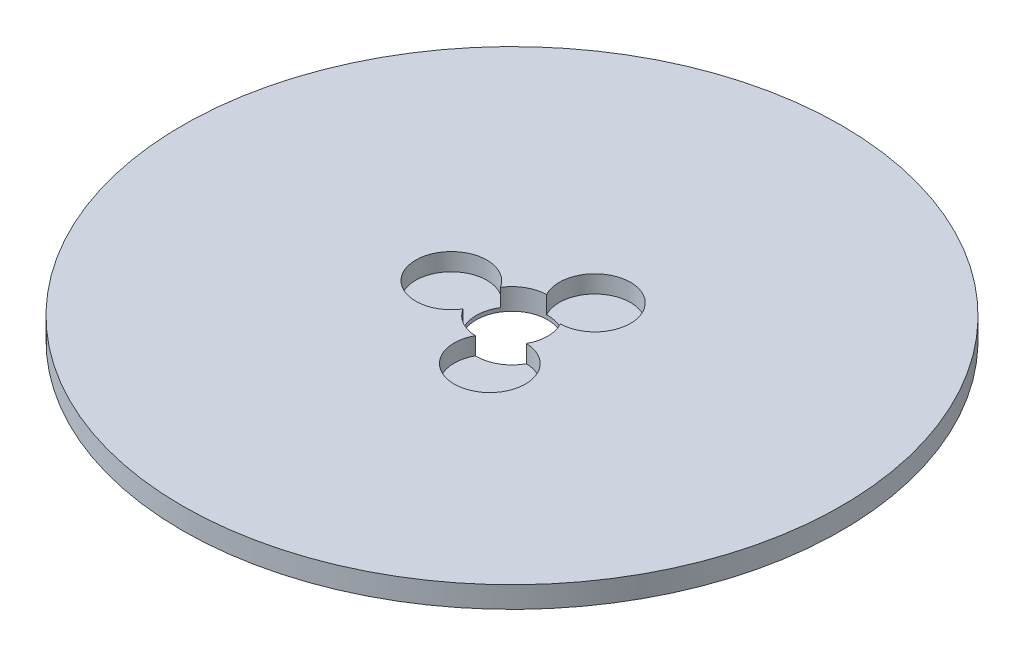
ISO-10303-21;
HEADER;
FILE_DESCRIPTION(('STEP AP214'),'2;1');
FILE_NAME('part.step','',(''),(''),'','','');
FILE_SCHEMA(('AUTOMOTIVE_DESIGN { 1 0 10303 214 1 1 1 1 }'));
ENDSEC;
DATA;
#1=APPLICATION_CONTEXT('core data for automotive mechanical design processes');
#2=APPLICATION_PROTOCOL_DEFINITION('international standard','automotive_design',2000,#1);
#3=PRODUCT_CONTEXT('',#1,'mechanical');
#4=PRODUCT('Part','Part','',(#3));
#5=PRODUCT_RELATED_PRODUCT_CATEGORY('part','',(#4));
#6=PRODUCT_DEFINITION_FORMATION('','',#4);
#7=PRODUCT_DEFINITION_CONTEXT('part definition',#1,'design');
#8=PRODUCT_DEFINITION('design','',#6,#7);
#9=PRODUCT_DEFINITION_SHAPE('','',#8);
#10=(LENGTH_UNIT() NAMED_UNIT(*) SI_UNIT(.MILLI.,.METRE.));
#11=(NAMED_UNIT(*) PLANE_ANGLE_UNIT() SI_UNIT($,.RADIAN.));
#12=(NAMED_UNIT(*) SI_UNIT($,.STERADIAN.) SOLID_ANGLE_UNIT());
#13=UNCERTAINTY_MEASURE_WITH_UNIT(LENGTH_MEASURE(1.E-05),#10,'distance_accuracy_value','');
#14=(GEOMETRIC_REPRESENTATION_CONTEXT(3) GLOBAL_UNCERTAINTY_ASSIGNED_CONTEXT((#13)) GLOBAL_UNIT_ASSIGNED_CONTEXT((#10,
#11,#12)) REPRESENTATION_CONTEXT('',''));
#15=CARTESIAN_POINT('',(0.,0.,0.));
#16=DIRECTION('',(0.,0.,1.));
#17=DIRECTION('',(1.,0.,0.));
#18=AXIS2_PLACEMENT_3D('',#15,#16,#17);
#19=CARTESIAN_POINT('',(0.,6.,0.));
#20=DIRECTION('',(0.,-1.,0.));
#21=DIRECTION('',(0.,0.,-1.));
#22=AXIS2_PLACEMENT_3D('',#19,#20,#21);
#23=CYLINDRICAL_SURFACE('',#22,92.5);
#24=CARTESIAN_POINT('',(0.,6.,0.));
#25=DIRECTION('',(0.,1.,0.));
#26=DIRECTION('',(0.,0.,1.));
#27=AXIS2_PLACEMENT_3D('',#24,#25,#26);
#28=CIRCLE('',#27,92.5);
#29=CARTESIAN_POINT('',(0.,6.,92.5));
#30=VERTEX_POINT('',#29);
#31=EDGE_CURVE('E126',#30,#30,#28,.T.);
#32=ORIENTED_EDGE('',*,*,#31,.F.);
#33=EDGE_LOOP('',(#32));
#34=FACE_BOUND('',#33,.T.);
#35=CARTESIAN_POINT('',(0.,0.,0.));
#36=DIRECTION('',(0.,1.,0.));
#37=DIRECTION('',(0.,0.,1.));
#38=AXIS2_PLACEMENT_3D('',#35,#36,#37);
#39=CIRCLE('',#38,92.5);
#40=CARTESIAN_POINT('',(0.,0.,92.5));
#41=VERTEX_POINT('',#40);
#42=EDGE_CURVE('E124',#41,#41,#39,.T.);
#43=ORIENTED_EDGE('',*,*,#42,.T.);
#44=EDGE_LOOP('',(#43));
#45=FACE_BOUND('',#44,.T.);
#46=ADVANCED_FACE('F39',(#34,#45),#23,.T.);
#47=CARTESIAN_POINT('',(0.,6.,0.));
#48=DIRECTION('',(0.,1.,0.));
#49=DIRECTION('',(0.,0.,1.));
#50=AXIS2_PLACEMENT_3D('',#47,#48,#49);
#51=PLANE('',#50);
#52=CARTESIAN_POINT('',(8.51482568205695,6.,14.7481106989148));
#53=DIRECTION('',(0.,1.,0.));
#54=DIRECTION('',(0.866025403784436,0.,-0.500000000000004));
#55=AXIS2_PLACEMENT_3D('',#52,#53,#54);
#56=CIRCLE('',#55,10.);
#57=CARTESIAN_POINT('',(-0.283876370543307,6.,9.99596989822634));
#58=VERTEX_POINT('',#57);
#59=CARTESIAN_POINT('',(8.79870205260026,6.,4.75214080068846));
#60=VERTEX_POINT('',#59);
#61=EDGE_CURVE('E147',#58,#60,#56,.T.);
#62=ORIENTED_EDGE('',*,*,#61,.F.);
#63=CARTESIAN_POINT('',(0.,6.,0.));
#64=DIRECTION('',(0.,1.,0.));
#65=DIRECTION('',(0.,0.,1.));
#66=AXIS2_PLACEMENT_3D('',#63,#64,#65);
#67=CIRCLE('',#66,10.);
#68=CARTESIAN_POINT('',(-8.51482568205688,6.,5.24382909753784));
#69=VERTEX_POINT('',#68);
#70=EDGE_CURVE('E118',#69,#58,#67,.T.);
#71=ORIENTED_EDGE('',*,*,#70,.F.);
#72=CARTESIAN_POINT('',(-17.0296513641138,6.,0.));
#73=DIRECTION('',(0.,1.,0.));
#74=DIRECTION('',(0.,0.,1.));
#75=AXIS2_PLACEMENT_3D('',#72,#73,#74);
#76=CIRCLE('',#75,10.);
#77=CARTESIAN_POINT('',(-8.51482568205688,6.,-5.24382909753784));
#78=VERTEX_POINT('',#77);
#79=EDGE_CURVE('E113',#78,#69,#76,.T.);
#80=ORIENTED_EDGE('',*,*,#79,.F.);
#81=CARTESIAN_POINT('',(-0.283876370543449,6.,-9.99596989822634));
#82=VERTEX_POINT('',#81);
#83=EDGE_CURVE('E106',#82,#78,#67,.T.);
#84=ORIENTED_EDGE('',*,*,#83,.F.);
#85=CARTESIAN_POINT('',(8.51482568205675,6.,-14.7481106989149));
#86=DIRECTION('',(0.,1.,0.));
#87=DIRECTION('',(-0.866025403784443,0.,-0.499999999999992));
#88=AXIS2_PLACEMENT_3D('',#85,#86,#87);
#89=CIRCLE('',#88,10.);
#90=CARTESIAN_POINT('',(8.79870205260019,6.,-4.75214080068858));
#91=VERTEX_POINT('',#90);
#92=EDGE_CURVE('E90',#91,#82,#89,.T.);
#93=ORIENTED_EDGE('',*,*,#92,.F.);
#94=EDGE_CURVE('E116',#60,#91,#67,.T.);
#95=ORIENTED_EDGE('',*,*,#94,.F.);
#96=EDGE_LOOP('',(#62,#71,#80,#84,#93,#95));
#97=FACE_BOUND('',#96,.T.);
#98=ORIENTED_EDGE('',*,*,#31,.T.);
#99=EDGE_LOOP('',(#98));
#100=FACE_BOUND('',#99,.T.);
#101=ADVANCED_FACE('F115',(#97,#100),#51,.T.);
#102=CARTESIAN_POINT('',(0.,0.,0.));
#103=DIRECTION('',(0.,1.,0.));
#104=DIRECTION('',(0.,0.,1.));
#105=AXIS2_PLACEMENT_3D('',#102,#103,#104);
#106=PLANE('',#105);
#107=CARTESIAN_POINT('',(0.,0.,0.));
#108=DIRECTION('',(0.,1.,0.));
#109=DIRECTION('',(0.,0.,1.));
#110=AXIS2_PLACEMENT_3D('',#107,#108,#109);
#111=CIRCLE('',#110,10.);
#112=CARTESIAN_POINT('',(0.,0.,10.));
#113=VERTEX_POINT('',#112);
#114=EDGE_CURVE('E120',#113,#113,#111,.T.);
#115=ORIENTED_EDGE('',*,*,#114,.T.);
#116=EDGE_LOOP('',(#115));
#117=FACE_BOUND('',#116,.T.);
#118=ORIENTED_EDGE('',*,*,#42,.F.);
#119=EDGE_LOOP('',(#118));
#120=FACE_BOUND('',#119,.T.);
#121=ADVANCED_FACE('F164',(#117,#120),#106,.F.);
#122=CARTESIAN_POINT('',(0.,6.,0.));
#123=DIRECTION('',(0.,-1.,0.));
#124=DIRECTION('',(0.,0.,-1.));
#125=AXIS2_PLACEMENT_3D('',#122,#123,#124);
#126=CYLINDRICAL_SURFACE('',#125,10.);
#127=DIRECTION('',(0.,1.,0.));
#128=VECTOR('',#127,1.);
#129=CARTESIAN_POINT('',(-0.283876370543307,3.54257301179844,9.99596989822634));
#130=LINE('',#129,#128);
#131=CARTESIAN_POINT('',(-0.283876370543307,1.08514602359689,9.99596989822634));
#132=VERTEX_POINT('',#131);
#133=EDGE_CURVE('E11',#132,#58,#130,.T.);
#134=ORIENTED_EDGE('',*,*,#133,.F.);
#135=CARTESIAN_POINT('',(0.,1.08514602359689,0.));
#136=DIRECTION('',(0.,1.,0.));
#137=DIRECTION('',(0.,0.,1.));
#138=AXIS2_PLACEMENT_3D('',#135,#136,#137);
#139=CIRCLE('',#138,10.);
#140=CARTESIAN_POINT('',(8.79870205260026,1.08514602359689,4.75214080068846));
#141=VERTEX_POINT('',#140);
#142=EDGE_CURVE('E144',#132,#141,#139,.T.);
#143=ORIENTED_EDGE('',*,*,#142,.T.);
#144=DIRECTION('',(0.,1.,0.));
#145=VECTOR('',#144,1.);
#146=CARTESIAN_POINT('',(8.79870205260026,3.54257301179844,4.75214080068846));
#147=LINE('',#146,#145);
#148=EDGE_CURVE('E46',#60,#141,#147,.F.);
#149=ORIENTED_EDGE('',*,*,#148,.F.);
#150=ORIENTED_EDGE('',*,*,#94,.T.);
#151=DIRECTION('',(0.,1.,0.));
#152=VECTOR('',#151,1.);
#153=CARTESIAN_POINT('',(8.79870205260019,3.54257301179844,-4.75214080068858));
#154=LINE('',#153,#152);
#155=CARTESIAN_POINT('',(8.79870205260019,1.08514602359689,-4.75214080068858));
#156=VERTEX_POINT('',#155);
#157=EDGE_CURVE('E92',#156,#91,#154,.T.);
#158=ORIENTED_EDGE('',*,*,#157,.F.);
#159=CARTESIAN_POINT('',(0.,1.08514602359689,0.));
#160=DIRECTION('',(0.,1.,0.));
#161=DIRECTION('',(0.,0.,1.));
#162=AXIS2_PLACEMENT_3D('',#159,#160,#161);
#163=CIRCLE('',#162,10.);
#164=CARTESIAN_POINT('',(-0.283876370543449,1.08514602359689,-9.99596989822634));
#165=VERTEX_POINT('',#164);
#166=EDGE_CURVE('E107',#156,#165,#163,.T.);
#167=ORIENTED_EDGE('',*,*,#166,.T.);
#168=DIRECTION('',(0.,1.,0.));
#169=VECTOR('',#168,1.);
#170=CARTESIAN_POINT('',(-0.283876370543449,3.54257301179844,-9.99596989822634));
#171=LINE('',#170,#169);
#172=EDGE_CURVE('E95',#82,#165,#171,.F.);
#173=ORIENTED_EDGE('',*,*,#172,.F.);
#174=ORIENTED_EDGE('',*,*,#83,.T.);
#175=DIRECTION('',(0.,1.,0.));
#176=VECTOR('',#175,1.);
#177=CARTESIAN_POINT('',(-8.51482568205688,3.54257301179844,-5.24382909753784));
#178=LINE('',#177,#176);
#179=CARTESIAN_POINT('',(-8.51482568205688,1.08514602359689,-5.24382909753784));
#180=VERTEX_POINT('',#179);
#181=EDGE_CURVE('E143',#180,#78,#178,.T.);
#182=ORIENTED_EDGE('',*,*,#181,.F.);
#183=CARTESIAN_POINT('',(0.,1.08514602359689,0.));
#184=DIRECTION('',(0.,1.,0.));
#185=DIRECTION('',(0.,0.,1.));
#186=AXIS2_PLACEMENT_3D('',#183,#184,#185);
#187=CIRCLE('',#186,10.);
#188=CARTESIAN_POINT('',(-8.51482568205688,1.08514602359689,5.24382909753784));
#189=VERTEX_POINT('',#188);
#190=EDGE_CURVE('E132',#180,#189,#187,.T.);
#191=ORIENTED_EDGE('',*,*,#190,.T.);
#192=DIRECTION('',(0.,1.,0.));
#193=VECTOR('',#192,1.);
#194=CARTESIAN_POINT('',(-8.51482568205688,3.54257301179844,5.24382909753784));
#195=LINE('',#194,#193);
#196=EDGE_CURVE('E137',#69,#189,#195,.F.);
#197=ORIENTED_EDGE('',*,*,#196,.F.);
#198=ORIENTED_EDGE('',*,*,#70,.T.);
#199=EDGE_LOOP('',(#134,#143,#149,#150,#158,#167,#173,#174,#182,#191,#197,#198));
#200=FACE_BOUND('',#199,.T.);
#201=ORIENTED_EDGE('',*,*,#114,.F.);
#202=EDGE_LOOP('',(#201));
#203=FACE_BOUND('',#202,.T.);
#204=ADVANCED_FACE('F103',(#200,#203),#126,.F.);
#205=CARTESIAN_POINT('',(-17.0296513641138,1.08514602359689,0.));
#206=DIRECTION('',(0.,1.,0.));
#207=DIRECTION('',(0.,0.,1.));
#208=AXIS2_PLACEMENT_3D('',#205,#206,#207);
#209=CYLINDRICAL_SURFACE('',#208,10.);
#210=ORIENTED_EDGE('',*,*,#181,.T.);
#211=ORIENTED_EDGE('',*,*,#79,.T.);
#212=ORIENTED_EDGE('',*,*,#196,.T.);
#213=CARTESIAN_POINT('',(-17.0296513641138,1.08514602359689,0.));
#214=DIRECTION('',(0.,1.,0.));
#215=DIRECTION('',(0.,0.,1.));
#216=AXIS2_PLACEMENT_3D('',#213,#214,#215);
#217=CIRCLE('',#216,10.);
#218=EDGE_CURVE('E121',#180,#189,#217,.T.);
#219=ORIENTED_EDGE('',*,*,#218,.F.);
#220=EDGE_LOOP('',(#210,#211,#212,#219));
#221=FACE_BOUND('',#220,.T.);
#222=ADVANCED_FACE('F174',(#221),#209,.F.);
#223=CARTESIAN_POINT('',(-17.0296513641138,1.08514602359689,0.));
#224=DIRECTION('',(0.,1.,0.));
#225=DIRECTION('',(0.,0.,1.));
#226=AXIS2_PLACEMENT_3D('',#223,#224,#225);
#227=PLANE('',#226);
#228=ORIENTED_EDGE('',*,*,#218,.T.);
#229=ORIENTED_EDGE('',*,*,#190,.F.);
#230=EDGE_LOOP('',(#228,#229));
#231=FACE_BOUND('',#230,.T.);
#232=ADVANCED_FACE('F177',(#231),#227,.T.);
#233=CARTESIAN_POINT('',(8.51482568205675,1.08514602359689,-14.7481106989149));
#234=DIRECTION('',(0.,1.,0.));
#235=DIRECTION('',(0.,0.,1.));
#236=AXIS2_PLACEMENT_3D('',#233,#234,#235);
#237=CYLINDRICAL_SURFACE('',#236,10.);
#238=ORIENTED_EDGE('',*,*,#157,.T.);
#239=ORIENTED_EDGE('',*,*,#92,.T.);
#240=ORIENTED_EDGE('',*,*,#172,.T.);
#241=CARTESIAN_POINT('',(8.51482568205675,1.08514602359689,-14.7481106989149));
#242=DIRECTION('',(0.,1.,0.));
#243=DIRECTION('',(-0.866025403784443,0.,-0.499999999999992));
#244=AXIS2_PLACEMENT_3D('',#241,#242,#243);
#245=CIRCLE('',#244,10.);
#246=EDGE_CURVE('E56',#156,#165,#245,.T.);
#247=ORIENTED_EDGE('',*,*,#246,.F.);
#248=EDGE_LOOP('',(#238,#239,#240,#247));
#249=FACE_BOUND('',#248,.T.);
#250=ADVANCED_FACE('F93',(#249),#237,.F.);
#251=CARTESIAN_POINT('',(8.51482568205675,1.08514602359689,-14.7481106989149));
#252=DIRECTION('',(0.,1.,0.));
#253=DIRECTION('',(-0.866025403784443,0.,-0.499999999999992));
#254=AXIS2_PLACEMENT_3D('',#251,#252,#253);
#255=PLANE('',#254);
#256=ORIENTED_EDGE('',*,*,#246,.T.);
#257=ORIENTED_EDGE('',*,*,#166,.F.);
#258=EDGE_LOOP('',(#256,#257));
#259=FACE_BOUND('',#258,.T.);
#260=ADVANCED_FACE('F160',(#259),#255,.T.);
#261=CARTESIAN_POINT('',(8.51482568205695,1.08514602359689,14.7481106989148));
#262=DIRECTION('',(0.,1.,0.));
#263=DIRECTION('',(0.,0.,1.));
#264=AXIS2_PLACEMENT_3D('',#261,#262,#263);
#265=CYLINDRICAL_SURFACE('',#264,10.);
#266=ORIENTED_EDGE('',*,*,#133,.T.);
#267=ORIENTED_EDGE('',*,*,#61,.T.);
#268=ORIENTED_EDGE('',*,*,#148,.T.);
#269=CARTESIAN_POINT('',(8.51482568205695,1.08514602359689,14.7481106989148));
#270=DIRECTION('',(0.,1.,0.));
#271=DIRECTION('',(0.866025403784436,0.,-0.500000000000004));
#272=AXIS2_PLACEMENT_3D('',#269,#270,#271);
#273=CIRCLE('',#272,10.);
#274=EDGE_CURVE('E55',#132,#141,#273,.T.);
#275=ORIENTED_EDGE('',*,*,#274,.F.);
#276=EDGE_LOOP('',(#266,#267,#268,#275));
#277=FACE_BOUND('',#276,.T.);
#278=ADVANCED_FACE('F149',(#277),#265,.F.);
#279=CARTESIAN_POINT('',(8.51482568205695,1.08514602359689,14.7481106989148));
#280=DIRECTION('',(0.,1.,0.));
#281=DIRECTION('',(0.866025403784436,0.,-0.500000000000004));
#282=AXIS2_PLACEMENT_3D('',#279,#280,#281);
#283=PLANE('',#282);
#284=ORIENTED_EDGE('',*,*,#274,.T.);
#285=ORIENTED_EDGE('',*,*,#142,.F.);
#286=EDGE_LOOP('',(#284,#285));
#287=FACE_BOUND('',#286,.T.);
#288=ADVANCED_FACE('F151',(#287),#283,.T.);
#289=CLOSED_SHELL('',(#46,#101,#121,#204,#222,#232,#250,#260,#278,#288));
#290=MANIFOLD_SOLID_BREP('B2',#289);
#291=ADVANCED_BREP_SHAPE_REPRESENTATION('',(#18,#290),#14);
#292=SHAPE_DEFINITION_REPRESENTATION(#9,#291);
ENDSEC;
END-ISO-10303-21;
